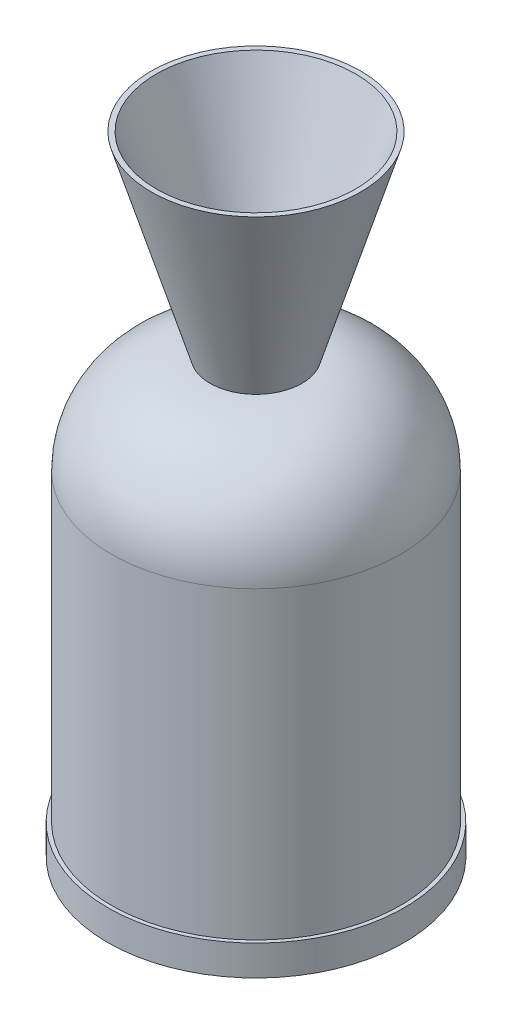
ISO-10303-21;
HEADER;
FILE_DESCRIPTION(('STEP AP214'),'2;1');
FILE_NAME('part.step','',(''),(''),'','','');
FILE_SCHEMA(('AUTOMOTIVE_DESIGN { 1 0 10303 214 1 1 1 1 }'));
ENDSEC;
DATA;
#1=APPLICATION_CONTEXT('core data for automotive mechanical design processes');
#2=APPLICATION_PROTOCOL_DEFINITION('international standard','automotive_design',2000,#1);
#3=PRODUCT_CONTEXT('',#1,'mechanical');
#4=PRODUCT('Part','Part','',(#3));
#5=PRODUCT_RELATED_PRODUCT_CATEGORY('part','',(#4));
#6=PRODUCT_DEFINITION_FORMATION('','',#4);
#7=PRODUCT_DEFINITION_CONTEXT('part definition',#1,'design');
#8=PRODUCT_DEFINITION('design','',#6,#7);
#9=PRODUCT_DEFINITION_SHAPE('','',#8);
#10=(LENGTH_UNIT() NAMED_UNIT(*) SI_UNIT(.MILLI.,.METRE.));
#11=(NAMED_UNIT(*) PLANE_ANGLE_UNIT() SI_UNIT($,.RADIAN.));
#12=(NAMED_UNIT(*) SI_UNIT($,.STERADIAN.) SOLID_ANGLE_UNIT());
#13=UNCERTAINTY_MEASURE_WITH_UNIT(LENGTH_MEASURE(1.E-05),#10,'distance_accuracy_value','');
#14=(GEOMETRIC_REPRESENTATION_CONTEXT(3) GLOBAL_UNCERTAINTY_ASSIGNED_CONTEXT((#13)) GLOBAL_UNIT_ASSIGNED_CONTEXT((#10,
#11,#12)) REPRESENTATION_CONTEXT('',''));
#15=CARTESIAN_POINT('',(0.,0.,0.));
#16=DIRECTION('',(0.,0.,1.));
#17=DIRECTION('',(1.,0.,0.));
#18=AXIS2_PLACEMENT_3D('',#15,#16,#17);
#19=CARTESIAN_POINT('',(0.,75.1,0.));
#20=DIRECTION('',(0.,-1.,0.));
#21=DIRECTION('',(0.,0.,-1.));
#22=AXIS2_PLACEMENT_3D('',#19,#20,#21);
#23=DEGENERATE_TOROIDAL_SURFACE('',#22,36.32,65.7858418105329,.T.);
#24=CARTESIAN_POINT('',(0.,75.1,0.));
#25=DIRECTION('',(0.,-1.,0.));
#26=DIRECTION('',(0.,0.,-1.));
#27=AXIS2_PLACEMENT_3D('',#24,#25,#26);
#28=CIRCLE('',#27,102.105841810533);
#29=CARTESIAN_POINT('',(0.,75.1,-102.105841810533));
#30=VERTEX_POINT('',#29);
#31=EDGE_CURVE('E11',#30,#30,#28,.T.);
#32=ORIENTED_EDGE('',*,*,#31,.T.);
#33=EDGE_LOOP('',(#32));
#34=FACE_BOUND('',#33,.T.);
#35=CARTESIAN_POINT('',(0.,9.31415818946713,0.));
#36=DIRECTION('',(0.,-1.,0.));
#37=DIRECTION('',(0.,0.,-1.));
#38=AXIS2_PLACEMENT_3D('',#35,#36,#37);
#39=CIRCLE('',#38,36.32);
#40=CARTESIAN_POINT('',(0.,9.31415818946713,-36.32));
#41=VERTEX_POINT('',#40);
#42=EDGE_CURVE('E64',#41,#41,#39,.T.);
#43=ORIENTED_EDGE('',*,*,#42,.F.);
#44=EDGE_LOOP('',(#43));
#45=FACE_BOUND('',#44,.T.);
#46=ADVANCED_FACE('F39',(#34,#45),#23,.T.);
#47=CARTESIAN_POINT('',(0.,0.,0.));
#48=DIRECTION('',(0.,-1.,0.));
#49=DIRECTION('',(0.,0.,-1.));
#50=AXIS2_PLACEMENT_3D('',#47,#48,#49);
#51=CYLINDRICAL_SURFACE('',#50,102.105841810533);
#52=CARTESIAN_POINT('',(0.,264.3,0.));
#53=DIRECTION('',(0.,-1.,0.));
#54=DIRECTION('',(0.,0.,-1.));
#55=AXIS2_PLACEMENT_3D('',#52,#53,#54);
#56=CIRCLE('',#55,102.105841810533);
#57=CARTESIAN_POINT('',(0.,264.3,-102.105841810533));
#58=VERTEX_POINT('',#57);
#59=EDGE_CURVE('E45',#58,#58,#56,.T.);
#60=ORIENTED_EDGE('',*,*,#59,.T.);
#61=EDGE_LOOP('',(#60));
#62=FACE_BOUND('',#61,.T.);
#63=ORIENTED_EDGE('',*,*,#31,.F.);
#64=EDGE_LOOP('',(#63));
#65=FACE_BOUND('',#64,.T.);
#66=ADVANCED_FACE('F72',(#62,#65),#51,.T.);
#67=CARTESIAN_POINT('',(0.,259.616413242492,0.));
#68=DIRECTION('',(0.,-1.,0.));
#69=DIRECTION('',(0.,0.,-1.));
#70=AXIS2_PLACEMENT_3D('',#67,#68,#69);
#71=DEGENERATE_TOROIDAL_SURFACE('',#70,49.4099420135417,52.9036278560331,.T.);
#72=CARTESIAN_POINT('',(0.,312.520041098525,0.));
#73=DIRECTION('',(0.,-1.,0.));
#74=DIRECTION('',(0.,0.,-1.));
#75=AXIS2_PLACEMENT_3D('',#72,#73,#74);
#76=CIRCLE('',#75,49.4099420135417);
#77=CARTESIAN_POINT('',(0.,312.520041098525,-49.4099420135417));
#78=VERTEX_POINT('',#77);
#79=EDGE_CURVE('E49',#78,#78,#76,.T.);
#80=ORIENTED_EDGE('',*,*,#79,.T.);
#81=EDGE_LOOP('',(#80));
#82=FACE_BOUND('',#81,.T.);
#83=ORIENTED_EDGE('',*,*,#59,.F.);
#84=EDGE_LOOP('',(#83));
#85=FACE_BOUND('',#84,.T.);
#86=ADVANCED_FACE('F76',(#82,#85),#71,.T.);
#87=CARTESIAN_POINT('',(36.32,312.520041098525,0.));
#88=DIRECTION('',(0.,1.,0.));
#89=DIRECTION('',(0.,0.,1.));
#90=AXIS2_PLACEMENT_3D('',#87,#88,#89);
#91=PLANE('',#90);
#92=CARTESIAN_POINT('',(0.,312.520041098525,0.));
#93=DIRECTION('',(0.,-1.,0.));
#94=DIRECTION('',(0.,0.,-1.));
#95=AXIS2_PLACEMENT_3D('',#92,#93,#94);
#96=CIRCLE('',#95,36.32);
#97=CARTESIAN_POINT('',(0.,312.520041098525,-36.32));
#98=VERTEX_POINT('',#97);
#99=EDGE_CURVE('E53',#98,#98,#96,.T.);
#100=ORIENTED_EDGE('',*,*,#99,.T.);
#101=EDGE_LOOP('',(#100));
#102=FACE_BOUND('',#101,.T.);
#103=ORIENTED_EDGE('',*,*,#79,.F.);
#104=EDGE_LOOP('',(#103));
#105=FACE_BOUND('',#104,.T.);
#106=ADVANCED_FACE('F80',(#102,#105),#91,.T.);
#107=CARTESIAN_POINT('',(0.,312.520041098525,0.));
#108=DIRECTION('',(0.,1.,0.));
#109=DIRECTION('',(0.,0.,1.));
#110=AXIS2_PLACEMENT_3D('',#107,#108,#109);
#111=CONICAL_SURFACE('',#110,36.32,1.15042305772152);
#112=CARTESIAN_POINT('',(0.,304.8,0.));
#113=DIRECTION('',(0.,-1.,0.));
#114=DIRECTION('',(0.,0.,-1.));
#115=AXIS2_PLACEMENT_3D('',#112,#113,#114);
#116=CIRCLE('',#115,19.05);
#117=CARTESIAN_POINT('',(0.,304.8,-19.05));
#118=VERTEX_POINT('',#117);
#119=EDGE_CURVE('E58',#118,#118,#116,.T.);
#120=ORIENTED_EDGE('',*,*,#119,.T.);
#121=EDGE_LOOP('',(#120));
#122=FACE_BOUND('',#121,.T.);
#123=ORIENTED_EDGE('',*,*,#99,.F.);
#124=EDGE_LOOP('',(#123));
#125=FACE_BOUND('',#124,.T.);
#126=ADVANCED_FACE('F87',(#122,#125),#111,.F.);
#127=CARTESIAN_POINT('',(0.,0.,0.));
#128=DIRECTION('',(0.,-1.,0.));
#129=DIRECTION('',(0.,0.,-1.));
#130=AXIS2_PLACEMENT_3D('',#127,#128,#129);
#131=CYLINDRICAL_SURFACE('',#130,19.05);
#132=CARTESIAN_POINT('',(0.,9.31415818946713,0.));
#133=DIRECTION('',(0.,-1.,0.));
#134=DIRECTION('',(0.,0.,-1.));
#135=AXIS2_PLACEMENT_3D('',#132,#133,#134);
#136=CIRCLE('',#135,19.05);
#137=CARTESIAN_POINT('',(0.,9.31415818946713,-19.05));
#138=VERTEX_POINT('',#137);
#139=EDGE_CURVE('E61',#138,#138,#136,.T.);
#140=ORIENTED_EDGE('',*,*,#139,.T.);
#141=EDGE_LOOP('',(#140));
#142=FACE_BOUND('',#141,.T.);
#143=ORIENTED_EDGE('',*,*,#119,.F.);
#144=EDGE_LOOP('',(#143));
#145=FACE_BOUND('',#144,.T.);
#146=ADVANCED_FACE('F91',(#142,#145),#131,.F.);
#147=CARTESIAN_POINT('',(36.32,9.31415818946713,0.));
#148=DIRECTION('',(0.,-1.,0.));
#149=DIRECTION('',(0.,0.,-1.));
#150=AXIS2_PLACEMENT_3D('',#147,#148,#149);
#151=PLANE('',#150);
#152=ORIENTED_EDGE('',*,*,#42,.T.);
#153=EDGE_LOOP('',(#152));
#154=FACE_BOUND('',#153,.T.);
#155=ORIENTED_EDGE('',*,*,#139,.F.);
#156=EDGE_LOOP('',(#155));
#157=FACE_BOUND('',#156,.T.);
#158=ADVANCED_FACE('F68',(#154,#157),#151,.T.);
#159=CLOSED_SHELL('',(#46,#66,#86,#106,#126,#146,#158));
#160=MANIFOLD_SOLID_BREP('B2',#159);
#161=CARTESIAN_POINT('',(0.,264.3,0.));
#162=DIRECTION('',(0.,-1.,0.));
#163=DIRECTION('',(0.,0.,-1.));
#164=AXIS2_PLACEMENT_3D('',#161,#162,#163);
#165=DEGENERATE_TOROIDAL_SURFACE('',#164,36.32,77.98,.T.);
#166=CARTESIAN_POINT('',(0.,342.28,0.));
#167=DIRECTION('',(0.,-1.,0.));
#168=DIRECTION('',(0.,0.,-1.));
#169=AXIS2_PLACEMENT_3D('',#166,#167,#168);
#170=CIRCLE('',#169,36.32);
#171=CARTESIAN_POINT('',(0.,342.28,-36.32));
#172=VERTEX_POINT('',#171);
#173=EDGE_CURVE('E37',#172,#172,#170,.T.);
#174=ORIENTED_EDGE('',*,*,#173,.T.);
#175=EDGE_LOOP('',(#174));
#176=FACE_BOUND('',#175,.T.);
#177=CARTESIAN_POINT('',(0.,264.3,0.));
#178=DIRECTION('',(0.,-1.,0.));
#179=DIRECTION('',(0.,0.,-1.));
#180=AXIS2_PLACEMENT_3D('',#177,#178,#179);
#181=CIRCLE('',#180,114.3);
#182=CARTESIAN_POINT('',(0.,264.3,-114.3));
#183=VERTEX_POINT('',#182);
#184=EDGE_CURVE('E218',#183,#183,#181,.T.);
#185=ORIENTED_EDGE('',*,*,#184,.F.);
#186=EDGE_LOOP('',(#185));
#187=FACE_BOUND('',#186,.T.);
#188=ADVANCED_FACE('F146',(#176,#187),#165,.T.);
#189=CARTESIAN_POINT('',(0.,342.28,0.));
#190=DIRECTION('',(0.,1.,0.));
#191=DIRECTION('',(0.,0.,1.));
#192=AXIS2_PLACEMENT_3D('',#189,#190,#191);
#193=CONICAL_SURFACE('',#192,36.32,0.292574077919552);
#194=CARTESIAN_POINT('',(0.,496.6,0.));
#195=DIRECTION('',(0.,-1.,0.));
#196=DIRECTION('',(0.,0.,-1.));
#197=AXIS2_PLACEMENT_3D('',#194,#195,#196);
#198=CIRCLE('',#197,82.804);
#199=CARTESIAN_POINT('',(0.,496.6,-82.804));
#200=VERTEX_POINT('',#199);
#201=EDGE_CURVE('E152',#200,#200,#198,.T.);
#202=ORIENTED_EDGE('',*,*,#201,.T.);
#203=EDGE_LOOP('',(#202));
#204=FACE_BOUND('',#203,.T.);
#205=ORIENTED_EDGE('',*,*,#173,.F.);
#206=EDGE_LOOP('',(#205));
#207=FACE_BOUND('',#206,.T.);
#208=ADVANCED_FACE('F195',(#204,#207),#193,.T.);
#209=CARTESIAN_POINT('',(78.804,496.6,0.));
#210=DIRECTION('',(0.,1.,0.));
#211=DIRECTION('',(0.,0.,1.));
#212=AXIS2_PLACEMENT_3D('',#209,#210,#211);
#213=PLANE('',#212);
#214=CARTESIAN_POINT('',(0.,496.6,0.));
#215=DIRECTION('',(0.,-1.,0.));
#216=DIRECTION('',(0.,0.,-1.));
#217=AXIS2_PLACEMENT_3D('',#214,#215,#216);
#218=CIRCLE('',#217,78.804);
#219=CARTESIAN_POINT('',(0.,496.6,-78.804));
#220=VERTEX_POINT('',#219);
#221=EDGE_CURVE('E190',#220,#220,#218,.T.);
#222=ORIENTED_EDGE('',*,*,#221,.T.);
#223=EDGE_LOOP('',(#222));
#224=FACE_BOUND('',#223,.T.);
#225=ORIENTED_EDGE('',*,*,#201,.F.);
#226=EDGE_LOOP('',(#225));
#227=FACE_BOUND('',#226,.T.);
#228=ADVANCED_FACE('F198',(#224,#227),#213,.T.);
#229=CARTESIAN_POINT('',(0.,496.6,0.));
#230=DIRECTION('',(0.,1.,0.));
#231=DIRECTION('',(0.,0.,1.));
#232=AXIS2_PLACEMENT_3D('',#229,#230,#231);
#233=CONICAL_SURFACE('',#232,78.804,0.350335607470431);
#234=CARTESIAN_POINT('',(0.,405.50861181956,0.));
#235=DIRECTION('',(0.,-1.,0.));
#236=DIRECTION('',(0.,0.,-1.));
#237=AXIS2_PLACEMENT_3D('',#234,#235,#236);
#238=CIRCLE('',#237,45.5183990333362);
#239=CARTESIAN_POINT('',(0.,405.50861181956,-45.5183990333362));
#240=VERTEX_POINT('',#239);
#241=EDGE_CURVE('E187',#240,#240,#238,.T.);
#242=ORIENTED_EDGE('',*,*,#241,.T.);
#243=EDGE_LOOP('',(#242));
#244=FACE_BOUND('',#243,.T.);
#245=ORIENTED_EDGE('',*,*,#221,.F.);
#246=EDGE_LOOP('',(#245));
#247=FACE_BOUND('',#246,.T.);
#248=ADVANCED_FACE('F200',(#244,#247),#233,.F.);
#249=CARTESIAN_POINT('',(0.,422.813683986009,0.));
#250=DIRECTION('',(0.,-1.,0.));
#251=DIRECTION('',(0.,0.,-1.));
#252=AXIS2_PLACEMENT_3D('',#249,#250,#251);
#253=DEGENERATE_TOROIDAL_SURFACE('',#252,11.9318792715946,60.0000000000001,.F.);
#254=CARTESIAN_POINT('',(0.,373.66456132867,0.));
#255=DIRECTION('',(0.,-1.,0.));
#256=DIRECTION('',(0.,0.,-1.));
#257=AXIS2_PLACEMENT_3D('',#254,#255,#256);
#258=CIRCLE('',#257,22.4827069094685);
#259=CARTESIAN_POINT('',(0.,373.66456132867,-22.4827069094685));
#260=VERTEX_POINT('',#259);
#261=EDGE_CURVE('E184',#260,#260,#258,.T.);
#262=ORIENTED_EDGE('',*,*,#261,.T.);
#263=EDGE_LOOP('',(#262));
#264=FACE_BOUND('',#263,.T.);
#265=ORIENTED_EDGE('',*,*,#241,.F.);
#266=EDGE_LOOP('',(#265));
#267=FACE_BOUND('',#266,.T.);
#268=ADVANCED_FACE('F207',(#264,#267),#253,.T.);
#269=CARTESIAN_POINT('',(0.,349.09,0.));
#270=DIRECTION('',(0.,-1.,0.));
#271=DIRECTION('',(0.,0.,-1.));
#272=AXIS2_PLACEMENT_3D('',#269,#270,#271);
#273=TOROIDAL_SURFACE('',#272,39.69,30.);
#274=CARTESIAN_POINT('',(0.,319.265471080831,0.));
#275=DIRECTION('',(0.,-1.,0.));
#276=DIRECTION('',(0.,0.,-1.));
#277=AXIS2_PLACEMENT_3D('',#274,#275,#276);
#278=CIRCLE('',#277,42.9299806711806);
#279=CARTESIAN_POINT('',(0.,319.265471080831,-42.9299806711806));
#280=VERTEX_POINT('',#279);
#281=EDGE_CURVE('E181',#280,#280,#278,.T.);
#282=ORIENTED_EDGE('',*,*,#281,.T.);
#283=EDGE_LOOP('',(#282));
#284=FACE_BOUND('',#283,.T.);
#285=ORIENTED_EDGE('',*,*,#261,.F.);
#286=EDGE_LOOP('',(#285));
#287=FACE_BOUND('',#286,.T.);
#288=ADVANCED_FACE('F270',(#284,#287),#273,.T.);
#289=CARTESIAN_POINT('',(0.,259.616413242492,0.));
#290=DIRECTION('',(0.,-1.,0.));
#291=DIRECTION('',(0.,0.,-1.));
#292=AXIS2_PLACEMENT_3D('',#289,#290,#291);
#293=DEGENERATE_TOROIDAL_SURFACE('',#292,49.4099420135417,60.,.T.);
#294=CARTESIAN_POINT('',(0.,266.096374584853,0.));
#295=DIRECTION('',(0.,-1.,0.));
#296=DIRECTION('',(0.,0.,-1.));
#297=AXIS2_PLACEMENT_3D('',#294,#295,#296);
#298=CIRCLE('',#297,109.058999851881);
#299=CARTESIAN_POINT('',(0.,266.096374584853,-109.058999851881));
#300=VERTEX_POINT('',#299);
#301=EDGE_CURVE('E178',#300,#300,#298,.T.);
#302=ORIENTED_EDGE('',*,*,#301,.T.);
#303=EDGE_LOOP('',(#302));
#304=FACE_BOUND('',#303,.T.);
#305=ORIENTED_EDGE('',*,*,#281,.F.);
#306=EDGE_LOOP('',(#305));
#307=FACE_BOUND('',#306,.T.);
#308=ADVANCED_FACE('F266',(#304,#307),#293,.F.);
#309=CARTESIAN_POINT('',(0.,266.096374584853,0.));
#310=DIRECTION('',(0.,-1.,0.));
#311=DIRECTION('',(0.,0.,-1.));
#312=AXIS2_PLACEMENT_3D('',#309,#310,#311);
#313=CONICAL_SURFACE('',#312,109.058999851881,0.130056945455698);
#314=CARTESIAN_POINT('',(0.,264.3,0.));
#315=DIRECTION('',(0.,-1.,0.));
#316=DIRECTION('',(0.,0.,-1.));
#317=AXIS2_PLACEMENT_3D('',#314,#315,#316);
#318=CIRCLE('',#317,109.293957091837);
#319=CARTESIAN_POINT('',(0.,264.3,-109.293957091837));
#320=VERTEX_POINT('',#319);
#321=EDGE_CURVE('E169',#320,#320,#318,.T.);
#322=ORIENTED_EDGE('',*,*,#321,.T.);
#323=EDGE_LOOP('',(#322));
#324=FACE_BOUND('',#323,.T.);
#325=ORIENTED_EDGE('',*,*,#301,.F.);
#326=EDGE_LOOP('',(#325));
#327=FACE_BOUND('',#326,.T.);
#328=ADVANCED_FACE('F262',(#324,#327),#313,.F.);
#329=CARTESIAN_POINT('',(0.,264.3,0.));
#330=DIRECTION('',(0.,-1.,0.));
#331=DIRECTION('',(0.,0.,-1.));
#332=AXIS2_PLACEMENT_3D('',#329,#330,#331);
#333=CONICAL_SURFACE('',#332,109.293957091837,3.19392608909692E-05);
#334=CARTESIAN_POINT('',(0.,75.1,0.));
#335=DIRECTION('',(0.,-1.,0.));
#336=DIRECTION('',(0.,0.,-1.));
#337=AXIS2_PLACEMENT_3D('',#334,#335,#336);
#338=CIRCLE('',#337,109.3);
#339=CARTESIAN_POINT('',(0.,75.1,-109.3));
#340=VERTEX_POINT('',#339);
#341=EDGE_CURVE('E165',#340,#340,#338,.T.);
#342=ORIENTED_EDGE('',*,*,#341,.T.);
#343=EDGE_LOOP('',(#342));
#344=FACE_BOUND('',#343,.T.);
#345=ORIENTED_EDGE('',*,*,#321,.F.);
#346=EDGE_LOOP('',(#345));
#347=FACE_BOUND('',#346,.T.);
#348=ADVANCED_FACE('F259',(#344,#347),#333,.F.);
#349=CARTESIAN_POINT('',(0.,75.1,0.));
#350=DIRECTION('',(0.,-1.,0.));
#351=DIRECTION('',(0.,0.,-1.));
#352=AXIS2_PLACEMENT_3D('',#349,#350,#351);
#353=DEGENERATE_TOROIDAL_SURFACE('',#352,36.32,72.98,.T.);
#354=CARTESIAN_POINT('',(0.,5.34111682466719,0.));
#355=DIRECTION('',(0.,-1.,0.));
#356=DIRECTION('',(0.,0.,-1.));
#357=AXIS2_PLACEMENT_3D('',#354,#355,#356);
#358=CIRCLE('',#357,57.7624489769771);
#359=CARTESIAN_POINT('',(0.,5.34111682466719,-57.7624489769771));
#360=VERTEX_POINT('',#359);
#361=EDGE_CURVE('E163',#360,#360,#358,.T.);
#362=ORIENTED_EDGE('',*,*,#361,.T.);
#363=EDGE_LOOP('',(#362));
#364=FACE_BOUND('',#363,.T.);
#365=ORIENTED_EDGE('',*,*,#341,.F.);
#366=EDGE_LOOP('',(#365));
#367=FACE_BOUND('',#366,.T.);
#368=ADVANCED_FACE('F159',(#364,#367),#353,.F.);
#369=CARTESIAN_POINT('',(0.,5.34111682466719,0.));
#370=DIRECTION('',(0.,1.,0.));
#371=DIRECTION('',(0.,0.,1.));
#372=AXIS2_PLACEMENT_3D('',#369,#370,#371);
#373=CONICAL_SURFACE('',#372,57.7624489769771,1.56489088363415);
#374=CARTESIAN_POINT('',(0.,5.,0.));
#375=VERTEX_POINT('',#374);
#376=VERTEX_LOOP('',#375);
#377=FACE_BOUND('',#376,.T.);
#378=ORIENTED_EDGE('',*,*,#361,.F.);
#379=EDGE_LOOP('',(#378));
#380=FACE_BOUND('',#379,.T.);
#381=ADVANCED_FACE('F155',(#377,#380),#373,.F.);
#382=CARTESIAN_POINT('',(57.3169140589754,0.,0.));
#383=DIRECTION('',(0.,-1.,0.));
#384=DIRECTION('',(0.,0.,-1.));
#385=AXIS2_PLACEMENT_3D('',#382,#383,#384);
#386=PLANE('',#385);
#387=CARTESIAN_POINT('',(0.,0.,0.));
#388=DIRECTION('',(0.,-1.,0.));
#389=DIRECTION('',(0.,0.,-1.));
#390=AXIS2_PLACEMENT_3D('',#387,#388,#389);
#391=CIRCLE('',#390,57.3169140589754);
#392=CARTESIAN_POINT('',(0.,0.,-57.3169140589754));
#393=VERTEX_POINT('',#392);
#394=EDGE_CURVE('E166',#393,#393,#391,.T.);
#395=ORIENTED_EDGE('',*,*,#394,.T.);
#396=EDGE_LOOP('',(#395));
#397=FACE_BOUND('',#396,.T.);
#398=ADVANCED_FACE('F158',(#397),#386,.T.);
#399=CARTESIAN_POINT('',(0.,75.1,0.));
#400=DIRECTION('',(0.,-1.,0.));
#401=DIRECTION('',(0.,0.,-1.));
#402=AXIS2_PLACEMENT_3D('',#399,#400,#401);
#403=DEGENERATE_TOROIDAL_SURFACE('',#402,36.32,77.98,.T.);
#404=CARTESIAN_POINT('',(0.,47.6263762856081,0.));
#405=DIRECTION('',(0.,-1.,0.));
#406=DIRECTION('',(0.,0.,-1.));
#407=AXIS2_PLACEMENT_3D('',#404,#405,#406);
#408=CIRCLE('',#407,109.3);
#409=CARTESIAN_POINT('',(0.,47.6263762856081,-109.3));
#410=VERTEX_POINT('',#409);
#411=EDGE_CURVE('E172',#410,#410,#408,.T.);
#412=ORIENTED_EDGE('',*,*,#411,.T.);
#413=EDGE_LOOP('',(#412));
#414=FACE_BOUND('',#413,.T.);
#415=ORIENTED_EDGE('',*,*,#394,.F.);
#416=EDGE_LOOP('',(#415));
#417=FACE_BOUND('',#416,.T.);
#418=ADVANCED_FACE('F236',(#414,#417),#403,.T.);
#419=CARTESIAN_POINT('',(0.,0.,0.));
#420=DIRECTION('',(0.,-1.,0.));
#421=DIRECTION('',(0.,0.,-1.));
#422=AXIS2_PLACEMENT_3D('',#419,#420,#421);
#423=CYLINDRICAL_SURFACE('',#422,109.3);
#424=CARTESIAN_POINT('',(0.,0.,0.));
#425=DIRECTION('',(0.,-1.,0.));
#426=DIRECTION('',(0.,0.,-1.));
#427=AXIS2_PLACEMENT_3D('',#424,#425,#426);
#428=CIRCLE('',#427,109.3);
#429=CARTESIAN_POINT('',(0.,0.,-109.3));
#430=VERTEX_POINT('',#429);
#431=EDGE_CURVE('E231',#430,#430,#428,.T.);
#432=ORIENTED_EDGE('',*,*,#431,.T.);
#433=EDGE_LOOP('',(#432));
#434=FACE_BOUND('',#433,.T.);
#435=ORIENTED_EDGE('',*,*,#411,.F.);
#436=EDGE_LOOP('',(#435));
#437=FACE_BOUND('',#436,.T.);
#438=ADVANCED_FACE('F239',(#434,#437),#423,.F.);
#439=CARTESIAN_POINT('',(117.3,0.,0.));
#440=DIRECTION('',(0.,-1.,0.));
#441=DIRECTION('',(0.,0.,-1.));
#442=AXIS2_PLACEMENT_3D('',#439,#440,#441);
#443=PLANE('',#442);
#444=CARTESIAN_POINT('',(0.,0.,0.));
#445=DIRECTION('',(0.,-1.,0.));
#446=DIRECTION('',(0.,0.,-1.));
#447=AXIS2_PLACEMENT_3D('',#444,#445,#446);
#448=CIRCLE('',#447,117.3);
#449=CARTESIAN_POINT('',(0.,0.,-117.3));
#450=VERTEX_POINT('',#449);
#451=EDGE_CURVE('E228',#450,#450,#448,.T.);
#452=ORIENTED_EDGE('',*,*,#451,.T.);
#453=EDGE_LOOP('',(#452));
#454=FACE_BOUND('',#453,.T.);
#455=ORIENTED_EDGE('',*,*,#431,.F.);
#456=EDGE_LOOP('',(#455));
#457=FACE_BOUND('',#456,.T.);
#458=ADVANCED_FACE('F241',(#454,#457),#443,.T.);
#459=CARTESIAN_POINT('',(0.,0.,0.));
#460=DIRECTION('',(0.,-1.,0.));
#461=DIRECTION('',(0.,0.,-1.));
#462=AXIS2_PLACEMENT_3D('',#459,#460,#461);
#463=CYLINDRICAL_SURFACE('',#462,117.3);
#464=CARTESIAN_POINT('',(0.,23.9,0.));
#465=DIRECTION('',(0.,-1.,0.));
#466=DIRECTION('',(0.,0.,-1.));
#467=AXIS2_PLACEMENT_3D('',#464,#465,#466);
#468=CIRCLE('',#467,117.3);
#469=CARTESIAN_POINT('',(0.,23.9,-117.3));
#470=VERTEX_POINT('',#469);
#471=EDGE_CURVE('E223',#470,#470,#468,.T.);
#472=ORIENTED_EDGE('',*,*,#471,.T.);
#473=EDGE_LOOP('',(#472));
#474=FACE_BOUND('',#473,.T.);
#475=ORIENTED_EDGE('',*,*,#451,.F.);
#476=EDGE_LOOP('',(#475));
#477=FACE_BOUND('',#476,.T.);
#478=ADVANCED_FACE('F248',(#474,#477),#463,.T.);
#479=CARTESIAN_POINT('',(114.3,23.9,0.));
#480=DIRECTION('',(0.,1.,0.));
#481=DIRECTION('',(0.,0.,1.));
#482=AXIS2_PLACEMENT_3D('',#479,#480,#481);
#483=PLANE('',#482);
#484=CARTESIAN_POINT('',(0.,23.9,0.));
#485=DIRECTION('',(0.,-1.,0.));
#486=DIRECTION('',(0.,0.,-1.));
#487=AXIS2_PLACEMENT_3D('',#484,#485,#486);
#488=CIRCLE('',#487,114.3);
#489=CARTESIAN_POINT('',(0.,23.9,-114.3));
#490=VERTEX_POINT('',#489);
#491=EDGE_CURVE('E220',#490,#490,#488,.T.);
#492=ORIENTED_EDGE('',*,*,#491,.T.);
#493=EDGE_LOOP('',(#492));
#494=FACE_BOUND('',#493,.T.);
#495=ORIENTED_EDGE('',*,*,#471,.F.);
#496=EDGE_LOOP('',(#495));
#497=FACE_BOUND('',#496,.T.);
#498=ADVANCED_FACE('F339',(#494,#497),#483,.T.);
#499=CARTESIAN_POINT('',(0.,0.,0.));
#500=DIRECTION('',(0.,-1.,0.));
#501=DIRECTION('',(0.,0.,-1.));
#502=AXIS2_PLACEMENT_3D('',#499,#500,#501);
#503=CYLINDRICAL_SURFACE('',#502,114.3);
#504=ORIENTED_EDGE('',*,*,#184,.T.);
#505=EDGE_LOOP('',(#504));
#506=FACE_BOUND('',#505,.T.);
#507=ORIENTED_EDGE('',*,*,#491,.F.);
#508=EDGE_LOOP('',(#507));
#509=FACE_BOUND('',#508,.T.);
#510=ADVANCED_FACE('F348',(#506,#509),#503,.T.);
#511=CLOSED_SHELL('',(#188,#208,#228,#248,#268,#288,#308,#328,#348,#368,#381,#398,#418,#438,
#458,#478,#498,#510));
#512=MANIFOLD_SOLID_BREP('B6',#511);
#513=ADVANCED_BREP_SHAPE_REPRESENTATION('',(#18,#160,#512),#14);
#514=SHAPE_DEFINITION_REPRESENTATION(#9,#513);
ENDSEC;
END-ISO-10303-21;
